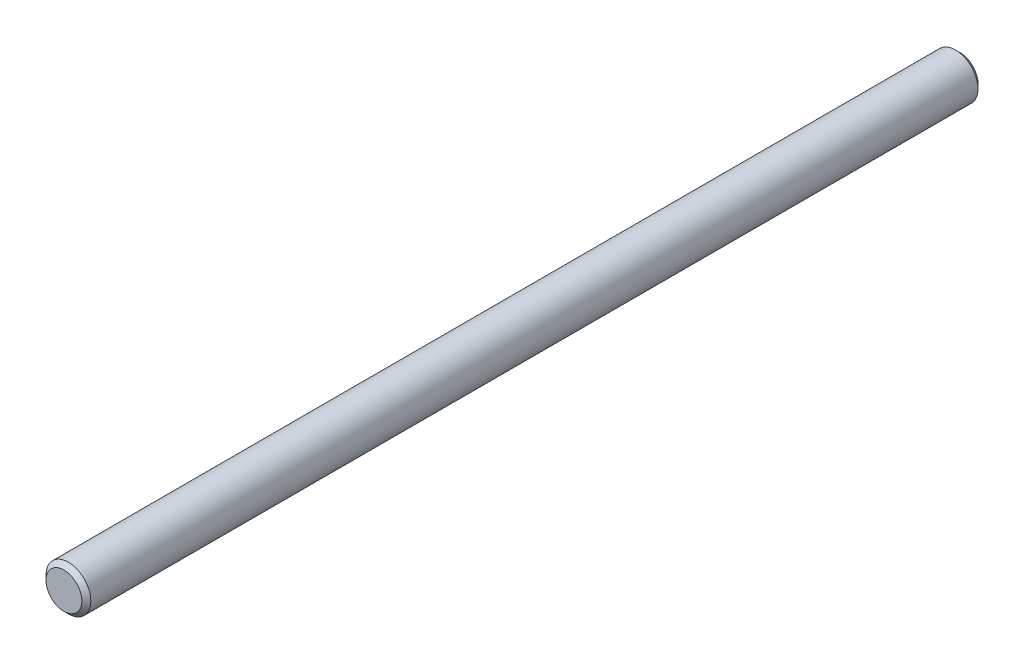
ISO-10303-21;
HEADER;
FILE_DESCRIPTION(('STEP AP214'),'2;1');
FILE_NAME('part.step','',(''),(''),'','','');
FILE_SCHEMA(('AUTOMOTIVE_DESIGN { 1 0 10303 214 1 1 1 1 }'));
ENDSEC;
DATA;
#1=APPLICATION_CONTEXT('core data for automotive mechanical design processes');
#2=APPLICATION_PROTOCOL_DEFINITION('international standard','automotive_design',2000,#1);
#3=PRODUCT_CONTEXT('',#1,'mechanical');
#4=PRODUCT('Part','Part','',(#3));
#5=PRODUCT_RELATED_PRODUCT_CATEGORY('part','',(#4));
#6=PRODUCT_DEFINITION_FORMATION('','',#4);
#7=PRODUCT_DEFINITION_CONTEXT('part definition',#1,'design');
#8=PRODUCT_DEFINITION('design','',#6,#7);
#9=PRODUCT_DEFINITION_SHAPE('','',#8);
#10=(LENGTH_UNIT() NAMED_UNIT(*) SI_UNIT(.MILLI.,.METRE.));
#11=(NAMED_UNIT(*) PLANE_ANGLE_UNIT() SI_UNIT($,.RADIAN.));
#12=(NAMED_UNIT(*) SI_UNIT($,.STERADIAN.) SOLID_ANGLE_UNIT());
#13=UNCERTAINTY_MEASURE_WITH_UNIT(LENGTH_MEASURE(1.E-05),#10,'distance_accuracy_value','');
#14=(GEOMETRIC_REPRESENTATION_CONTEXT(3) GLOBAL_UNCERTAINTY_ASSIGNED_CONTEXT((#13)) GLOBAL_UNIT_ASSIGNED_CONTEXT((#10,
#11,#12)) REPRESENTATION_CONTEXT('',''));
#15=CARTESIAN_POINT('',(0.,0.,0.));
#16=DIRECTION('',(0.,0.,1.));
#17=DIRECTION('',(1.,0.,0.));
#18=AXIS2_PLACEMENT_3D('',#15,#16,#17);
#19=CARTESIAN_POINT('',(0.,0.,100.));
#20=DIRECTION('',(0.,0.,-1.));
#21=DIRECTION('',(-1.,0.,0.));
#22=AXIS2_PLACEMENT_3D('',#19,#20,#21);
#23=CYLINDRICAL_SURFACE('',#22,2.5);
#24=CARTESIAN_POINT('',(0.,0.,0.500000000000014));
#25=DIRECTION('',(0.,0.,1.));
#26=DIRECTION('',(1.,0.,0.));
#27=AXIS2_PLACEMENT_3D('',#24,#25,#26);
#28=CIRCLE('',#27,2.5);
#29=CARTESIAN_POINT('',(2.5,0.,0.500000000000014));
#30=VERTEX_POINT('',#29);
#31=EDGE_CURVE('E58',#30,#30,#28,.T.);
#32=ORIENTED_EDGE('',*,*,#31,.T.);
#33=EDGE_LOOP('',(#32));
#34=FACE_BOUND('',#33,.T.);
#35=CARTESIAN_POINT('',(0.,0.,99.5));
#36=DIRECTION('',(0.,0.,1.));
#37=DIRECTION('',(1.,0.,0.));
#38=AXIS2_PLACEMENT_3D('',#35,#36,#37);
#39=CIRCLE('',#38,2.5);
#40=CARTESIAN_POINT('',(2.5,0.,99.5));
#41=VERTEX_POINT('',#40);
#42=EDGE_CURVE('E64',#41,#41,#39,.F.);
#43=ORIENTED_EDGE('',*,*,#42,.T.);
#44=EDGE_LOOP('',(#43));
#45=FACE_BOUND('',#44,.T.);
#46=ADVANCED_FACE('F41',(#34,#45),#23,.T.);
#47=CARTESIAN_POINT('',(0.,0.,100.));
#48=DIRECTION('',(0.,0.,1.));
#49=DIRECTION('',(1.,0.,0.));
#50=AXIS2_PLACEMENT_3D('',#47,#48,#49);
#51=PLANE('',#50);
#52=CARTESIAN_POINT('',(0.,0.,100.));
#53=DIRECTION('',(0.,0.,1.));
#54=DIRECTION('',(1.,0.,0.));
#55=AXIS2_PLACEMENT_3D('',#52,#53,#54);
#56=CIRCLE('',#55,2.);
#57=CARTESIAN_POINT('',(2.,0.,100.));
#58=VERTEX_POINT('',#57);
#59=EDGE_CURVE('E10',#58,#58,#56,.T.);
#60=ORIENTED_EDGE('',*,*,#59,.T.);
#61=EDGE_LOOP('',(#60));
#62=FACE_BOUND('',#61,.T.);
#63=ADVANCED_FACE('F80',(#62),#51,.T.);
#64=CARTESIAN_POINT('',(0.,0.,0.));
#65=DIRECTION('',(0.,0.,1.));
#66=DIRECTION('',(1.,0.,0.));
#67=AXIS2_PLACEMENT_3D('',#64,#65,#66);
#68=PLANE('',#67);
#69=CARTESIAN_POINT('',(0.,0.,0.));
#70=DIRECTION('',(0.,0.,1.));
#71=DIRECTION('',(1.,0.,0.));
#72=AXIS2_PLACEMENT_3D('',#69,#70,#71);
#73=CIRCLE('',#72,1.99999999999999);
#74=CARTESIAN_POINT('',(1.99999999999999,0.,0.));
#75=VERTEX_POINT('',#74);
#76=EDGE_CURVE('E50',#75,#75,#73,.F.);
#77=ORIENTED_EDGE('',*,*,#76,.T.);
#78=EDGE_LOOP('',(#77));
#79=FACE_BOUND('',#78,.T.);
#80=ADVANCED_FACE('F78',(#79),#68,.F.);
#81=CARTESIAN_POINT('',(0.,0.,0.500000000000014));
#82=DIRECTION('',(0.,0.,1.));
#83=DIRECTION('',(1.,0.,0.));
#84=AXIS2_PLACEMENT_3D('',#81,#82,#83);
#85=CONICAL_SURFACE('',#84,2.5,0.785398163397446);
#86=ORIENTED_EDGE('',*,*,#76,.F.);
#87=EDGE_LOOP('',(#86));
#88=FACE_BOUND('',#87,.T.);
#89=ORIENTED_EDGE('',*,*,#31,.F.);
#90=EDGE_LOOP('',(#89));
#91=FACE_BOUND('',#90,.T.);
#92=ADVANCED_FACE('F74',(#88,#91),#85,.T.);
#93=CARTESIAN_POINT('',(0.,0.,100.));
#94=DIRECTION('',(0.,0.,-1.));
#95=DIRECTION('',(-1.,0.,0.));
#96=AXIS2_PLACEMENT_3D('',#93,#94,#95);
#97=CONICAL_SURFACE('',#96,2.,0.785398163397446);
#98=ORIENTED_EDGE('',*,*,#42,.F.);
#99=EDGE_LOOP('',(#98));
#100=FACE_BOUND('',#99,.T.);
#101=ORIENTED_EDGE('',*,*,#59,.F.);
#102=EDGE_LOOP('',(#101));
#103=FACE_BOUND('',#102,.T.);
#104=ADVANCED_FACE('F44',(#100,#103),#97,.T.);
#105=CLOSED_SHELL('',(#46,#63,#80,#92,#104));
#106=MANIFOLD_SOLID_BREP('B2',#105);
#107=ADVANCED_BREP_SHAPE_REPRESENTATION('',(#18,#106),#14);
#108=SHAPE_DEFINITION_REPRESENTATION(#9,#107);
ENDSEC;
END-ISO-10303-21;
